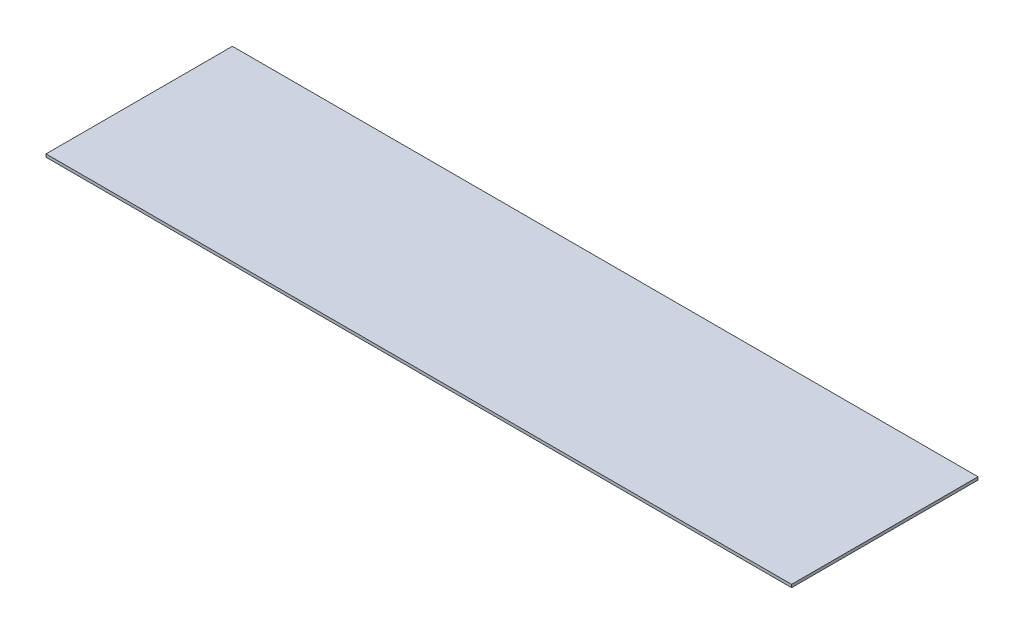
ISO-10303-21;
HEADER;
FILE_DESCRIPTION(('STEP AP214'),'2;1');
FILE_NAME('part.step','',(''),(''),'','','');
FILE_SCHEMA(('AUTOMOTIVE_DESIGN { 1 0 10303 214 1 1 1 1 }'));
ENDSEC;
DATA;
#1=APPLICATION_CONTEXT('core data for automotive mechanical design processes');
#2=APPLICATION_PROTOCOL_DEFINITION('international standard','automotive_design',2000,#1);
#3=PRODUCT_CONTEXT('',#1,'mechanical');
#4=PRODUCT('Part','Part','',(#3));
#5=PRODUCT_RELATED_PRODUCT_CATEGORY('part','',(#4));
#6=PRODUCT_DEFINITION_FORMATION('','',#4);
#7=PRODUCT_DEFINITION_CONTEXT('part definition',#1,'design');
#8=PRODUCT_DEFINITION('design','',#6,#7);
#9=PRODUCT_DEFINITION_SHAPE('','',#8);
#10=(LENGTH_UNIT() NAMED_UNIT(*) SI_UNIT(.MILLI.,.METRE.));
#11=(NAMED_UNIT(*) PLANE_ANGLE_UNIT() SI_UNIT($,.RADIAN.));
#12=(NAMED_UNIT(*) SI_UNIT($,.STERADIAN.) SOLID_ANGLE_UNIT());
#13=UNCERTAINTY_MEASURE_WITH_UNIT(LENGTH_MEASURE(1.E-05),#10,'distance_accuracy_value','');
#14=(GEOMETRIC_REPRESENTATION_CONTEXT(3) GLOBAL_UNCERTAINTY_ASSIGNED_CONTEXT((#13)) GLOBAL_UNIT_ASSIGNED_CONTEXT((#10,
#11,#12)) REPRESENTATION_CONTEXT('',''));
#15=CARTESIAN_POINT('',(0.,0.,0.));
#16=DIRECTION('',(0.,0.,1.));
#17=DIRECTION('',(1.,0.,0.));
#18=AXIS2_PLACEMENT_3D('',#15,#16,#17);
#19=CARTESIAN_POINT('',(0.,-1.5875,0.));
#20=DIRECTION('',(1.,0.,0.));
#21=DIRECTION('',(0.,0.,-1.));
#22=AXIS2_PLACEMENT_3D('',#19,#20,#21);
#23=PLANE('',#22);
#24=DIRECTION('',(0.,0.,-1.));
#25=VECTOR('',#24,1.);
#26=CARTESIAN_POINT('',(0.,0.,0.));
#27=LINE('',#26,#25);
#28=CARTESIAN_POINT('',(0.,0.,101.6));
#29=VERTEX_POINT('',#28);
#30=CARTESIAN_POINT('',(0.,0.,0.));
#31=VERTEX_POINT('',#30);
#32=EDGE_CURVE('E102',#29,#31,#27,.T.);
#33=ORIENTED_EDGE('',*,*,#32,.T.);
#34=DIRECTION('',(0.,1.,0.));
#35=VECTOR('',#34,1.);
#36=CARTESIAN_POINT('',(0.,-1.5875,0.));
#37=LINE('',#36,#35);
#38=CARTESIAN_POINT('',(0.,-1.5875,0.));
#39=VERTEX_POINT('',#38);
#40=EDGE_CURVE('E11',#39,#31,#37,.T.);
#41=ORIENTED_EDGE('',*,*,#40,.F.);
#42=DIRECTION('',(0.,0.,-1.));
#43=VECTOR('',#42,1.);
#44=CARTESIAN_POINT('',(0.,-1.5875,0.));
#45=LINE('',#44,#43);
#46=CARTESIAN_POINT('',(0.,-1.5875,101.6));
#47=VERTEX_POINT('',#46);
#48=EDGE_CURVE('E90',#47,#39,#45,.T.);
#49=ORIENTED_EDGE('',*,*,#48,.F.);
#50=DIRECTION('',(0.,1.,0.));
#51=VECTOR('',#50,1.);
#52=CARTESIAN_POINT('',(0.,-1.5875,101.6));
#53=LINE('',#52,#51);
#54=EDGE_CURVE('E98',#47,#29,#53,.T.);
#55=ORIENTED_EDGE('',*,*,#54,.T.);
#56=EDGE_LOOP('',(#33,#41,#49,#55));
#57=FACE_BOUND('',#56,.T.);
#58=ADVANCED_FACE('F39',(#57),#23,.F.);
#59=CARTESIAN_POINT('',(0.,-1.5875,0.));
#60=DIRECTION('',(0.,0.,1.));
#61=DIRECTION('',(1.,0.,0.));
#62=AXIS2_PLACEMENT_3D('',#59,#60,#61);
#63=PLANE('',#62);
#64=DIRECTION('',(1.,0.,0.));
#65=VECTOR('',#64,1.);
#66=CARTESIAN_POINT('',(0.,0.,0.));
#67=LINE('',#66,#65);
#68=CARTESIAN_POINT('',(406.4,0.,0.));
#69=VERTEX_POINT('',#68);
#70=EDGE_CURVE('E94',#31,#69,#67,.T.);
#71=ORIENTED_EDGE('',*,*,#70,.T.);
#72=DIRECTION('',(0.,1.,0.));
#73=VECTOR('',#72,1.);
#74=CARTESIAN_POINT('',(406.4,-1.5875,0.));
#75=LINE('',#74,#73);
#76=CARTESIAN_POINT('',(406.4,-1.5875,0.));
#77=VERTEX_POINT('',#76);
#78=EDGE_CURVE('E47',#77,#69,#75,.T.);
#79=ORIENTED_EDGE('',*,*,#78,.F.);
#80=DIRECTION('',(1.,0.,0.));
#81=VECTOR('',#80,1.);
#82=CARTESIAN_POINT('',(0.,-1.5875,0.));
#83=LINE('',#82,#81);
#84=EDGE_CURVE('E85',#39,#77,#83,.T.);
#85=ORIENTED_EDGE('',*,*,#84,.F.);
#86=ORIENTED_EDGE('',*,*,#40,.T.);
#87=EDGE_LOOP('',(#71,#79,#85,#86));
#88=FACE_BOUND('',#87,.T.);
#89=ADVANCED_FACE('F93',(#88),#63,.F.);
#90=CARTESIAN_POINT('',(406.4,-1.5875,0.));
#91=DIRECTION('',(-1.,0.,0.));
#92=DIRECTION('',(0.,0.,1.));
#93=AXIS2_PLACEMENT_3D('',#90,#91,#92);
#94=PLANE('',#93);
#95=DIRECTION('',(0.,0.,1.));
#96=VECTOR('',#95,1.);
#97=CARTESIAN_POINT('',(406.4,0.,0.));
#98=LINE('',#97,#96);
#99=CARTESIAN_POINT('',(406.4,0.,101.6));
#100=VERTEX_POINT('',#99);
#101=EDGE_CURVE('E72',#69,#100,#98,.T.);
#102=ORIENTED_EDGE('',*,*,#101,.T.);
#103=DIRECTION('',(0.,1.,0.));
#104=VECTOR('',#103,1.);
#105=CARTESIAN_POINT('',(406.4,-1.5875,101.6));
#106=LINE('',#105,#104);
#107=CARTESIAN_POINT('',(406.4,-1.5875,101.6));
#108=VERTEX_POINT('',#107);
#109=EDGE_CURVE('E95',#108,#100,#106,.T.);
#110=ORIENTED_EDGE('',*,*,#109,.F.);
#111=DIRECTION('',(0.,0.,1.));
#112=VECTOR('',#111,1.);
#113=CARTESIAN_POINT('',(406.4,-1.5875,0.));
#114=LINE('',#113,#112);
#115=EDGE_CURVE('E88',#77,#108,#114,.T.);
#116=ORIENTED_EDGE('',*,*,#115,.F.);
#117=ORIENTED_EDGE('',*,*,#78,.T.);
#118=EDGE_LOOP('',(#102,#110,#116,#117));
#119=FACE_BOUND('',#118,.T.);
#120=ADVANCED_FACE('F96',(#119),#94,.F.);
#121=CARTESIAN_POINT('',(0.,-1.5875,101.6));
#122=DIRECTION('',(0.,0.,-1.));
#123=DIRECTION('',(-1.,0.,0.));
#124=AXIS2_PLACEMENT_3D('',#121,#122,#123);
#125=PLANE('',#124);
#126=DIRECTION('',(-1.,0.,0.));
#127=VECTOR('',#126,1.);
#128=CARTESIAN_POINT('',(0.,0.,101.6));
#129=LINE('',#128,#127);
#130=EDGE_CURVE('E78',#100,#29,#129,.T.);
#131=ORIENTED_EDGE('',*,*,#130,.T.);
#132=ORIENTED_EDGE('',*,*,#54,.F.);
#133=DIRECTION('',(-1.,0.,0.));
#134=VECTOR('',#133,1.);
#135=CARTESIAN_POINT('',(0.,-1.5875,101.6));
#136=LINE('',#135,#134);
#137=EDGE_CURVE('E55',#108,#47,#136,.T.);
#138=ORIENTED_EDGE('',*,*,#137,.F.);
#139=ORIENTED_EDGE('',*,*,#109,.T.);
#140=EDGE_LOOP('',(#131,#132,#138,#139));
#141=FACE_BOUND('',#140,.T.);
#142=ADVANCED_FACE('F109',(#141),#125,.F.);
#143=CARTESIAN_POINT('',(0.,-1.5875,0.));
#144=DIRECTION('',(0.,1.,0.));
#145=DIRECTION('',(0.,0.,1.));
#146=AXIS2_PLACEMENT_3D('',#143,#144,#145);
#147=PLANE('',#146);
#148=ORIENTED_EDGE('',*,*,#48,.T.);
#149=ORIENTED_EDGE('',*,*,#84,.T.);
#150=ORIENTED_EDGE('',*,*,#115,.T.);
#151=ORIENTED_EDGE('',*,*,#137,.T.);
#152=EDGE_LOOP('',(#148,#149,#150,#151));
#153=FACE_BOUND('',#152,.T.);
#154=ADVANCED_FACE('F86',(#153),#147,.F.);
#155=CARTESIAN_POINT('',(0.,0.,0.));
#156=DIRECTION('',(0.,1.,0.));
#157=DIRECTION('',(0.,0.,1.));
#158=AXIS2_PLACEMENT_3D('',#155,#156,#157);
#159=PLANE('',#158);
#160=ORIENTED_EDGE('',*,*,#32,.F.);
#161=ORIENTED_EDGE('',*,*,#130,.F.);
#162=ORIENTED_EDGE('',*,*,#101,.F.);
#163=ORIENTED_EDGE('',*,*,#70,.F.);
#164=EDGE_LOOP('',(#160,#161,#162,#163));
#165=FACE_BOUND('',#164,.T.);
#166=ADVANCED_FACE('F112',(#165),#159,.T.);
#167=CLOSED_SHELL('',(#58,#89,#120,#142,#154,#166));
#168=MANIFOLD_SOLID_BREP('B2',#167);
#169=ADVANCED_BREP_SHAPE_REPRESENTATION('',(#18,#168),#14);
#170=SHAPE_DEFINITION_REPRESENTATION(#9,#169);
ENDSEC;
END-ISO-10303-21;
